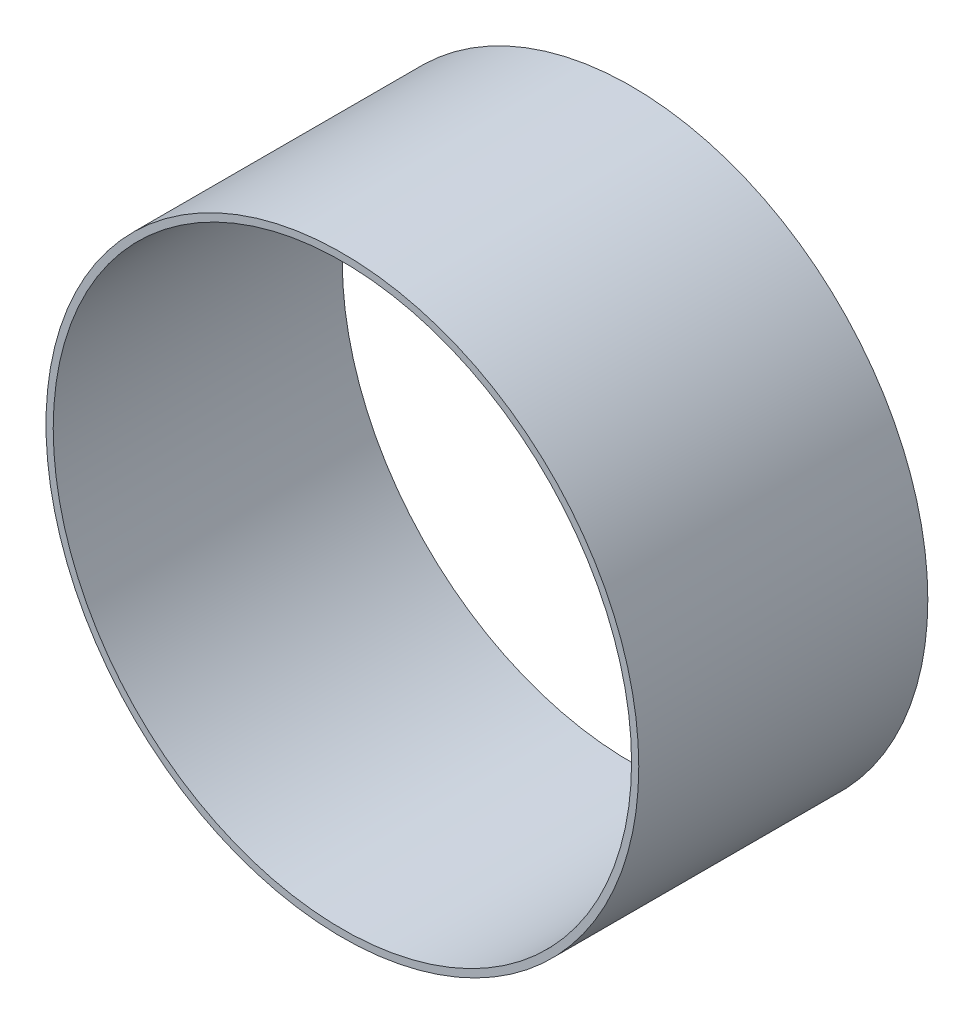
ISO-10303-21;
HEADER;
FILE_DESCRIPTION(('STEP AP214'),'2;1');
FILE_NAME('part.step','',(''),(''),'','','');
FILE_SCHEMA(('AUTOMOTIVE_DESIGN { 1 0 10303 214 1 1 1 1 }'));
ENDSEC;
DATA;
#1=APPLICATION_CONTEXT('core data for automotive mechanical design processes');
#2=APPLICATION_PROTOCOL_DEFINITION('international standard','automotive_design',2000,#1);
#3=PRODUCT_CONTEXT('',#1,'mechanical');
#4=PRODUCT('Part','Part','',(#3));
#5=PRODUCT_RELATED_PRODUCT_CATEGORY('part','',(#4));
#6=PRODUCT_DEFINITION_FORMATION('','',#4);
#7=PRODUCT_DEFINITION_CONTEXT('part definition',#1,'design');
#8=PRODUCT_DEFINITION('design','',#6,#7);
#9=PRODUCT_DEFINITION_SHAPE('','',#8);
#10=(LENGTH_UNIT() NAMED_UNIT(*) SI_UNIT(.MILLI.,.METRE.));
#11=(NAMED_UNIT(*) PLANE_ANGLE_UNIT() SI_UNIT($,.RADIAN.));
#12=(NAMED_UNIT(*) SI_UNIT($,.STERADIAN.) SOLID_ANGLE_UNIT());
#13=UNCERTAINTY_MEASURE_WITH_UNIT(LENGTH_MEASURE(1.E-05),#10,'distance_accuracy_value','');
#14=(GEOMETRIC_REPRESENTATION_CONTEXT(3) GLOBAL_UNCERTAINTY_ASSIGNED_CONTEXT((#13)) GLOBAL_UNIT_ASSIGNED_CONTEXT((#10,
#11,#12)) REPRESENTATION_CONTEXT('',''));
#15=CARTESIAN_POINT('',(0.,0.,0.));
#16=DIRECTION('',(0.,0.,1.));
#17=DIRECTION('',(1.,0.,0.));
#18=AXIS2_PLACEMENT_3D('',#15,#16,#17);
#19=CARTESIAN_POINT('',(0.,0.,20.));
#20=DIRECTION('',(0.,0.,1.));
#21=DIRECTION('',(1.,0.,0.));
#22=AXIS2_PLACEMENT_3D('',#19,#20,#21);
#23=PLANE('',#22);
#24=CARTESIAN_POINT('',(0.,0.,20.));
#25=DIRECTION('',(0.,0.,1.));
#26=DIRECTION('',(1.,0.,0.));
#27=AXIS2_PLACEMENT_3D('',#24,#25,#26);
#28=CIRCLE('',#27,41.016);
#29=CARTESIAN_POINT('',(41.016,0.,20.));
#30=VERTEX_POINT('',#29);
#31=EDGE_CURVE('E11',#30,#30,#28,.T.);
#32=ORIENTED_EDGE('',*,*,#31,.T.);
#33=EDGE_LOOP('',(#32));
#34=FACE_BOUND('',#33,.T.);
#35=CARTESIAN_POINT('',(0.,0.,20.));
#36=DIRECTION('',(0.,0.,1.));
#37=DIRECTION('',(1.,0.,0.));
#38=AXIS2_PLACEMENT_3D('',#35,#36,#37);
#39=CIRCLE('',#38,40.016);
#40=CARTESIAN_POINT('',(40.016,0.,20.));
#41=VERTEX_POINT('',#40);
#42=EDGE_CURVE('E47',#41,#41,#39,.T.);
#43=ORIENTED_EDGE('',*,*,#42,.F.);
#44=EDGE_LOOP('',(#43));
#45=FACE_BOUND('',#44,.T.);
#46=ADVANCED_FACE('F36',(#34,#45),#23,.T.);
#47=CARTESIAN_POINT('',(0.,0.,-20.));
#48=DIRECTION('',(0.,0.,1.));
#49=DIRECTION('',(1.,0.,0.));
#50=AXIS2_PLACEMENT_3D('',#47,#48,#49);
#51=PLANE('',#50);
#52=CARTESIAN_POINT('',(0.,0.,-20.));
#53=DIRECTION('',(0.,0.,1.));
#54=DIRECTION('',(1.,0.,0.));
#55=AXIS2_PLACEMENT_3D('',#52,#53,#54);
#56=CIRCLE('',#55,41.016);
#57=CARTESIAN_POINT('',(41.016,0.,-20.));
#58=VERTEX_POINT('',#57);
#59=EDGE_CURVE('E40',#58,#58,#56,.T.);
#60=ORIENTED_EDGE('',*,*,#59,.F.);
#61=EDGE_LOOP('',(#60));
#62=FACE_BOUND('',#61,.T.);
#63=CARTESIAN_POINT('',(0.,0.,-20.));
#64=DIRECTION('',(0.,0.,1.));
#65=DIRECTION('',(1.,0.,0.));
#66=AXIS2_PLACEMENT_3D('',#63,#64,#65);
#67=CIRCLE('',#66,40.016);
#68=CARTESIAN_POINT('',(40.016,0.,-20.));
#69=VERTEX_POINT('',#68);
#70=EDGE_CURVE('E49',#69,#69,#67,.T.);
#71=ORIENTED_EDGE('',*,*,#70,.T.);
#72=EDGE_LOOP('',(#71));
#73=FACE_BOUND('',#72,.T.);
#74=ADVANCED_FACE('F59',(#62,#73),#51,.F.);
#75=CARTESIAN_POINT('',(0.,0.,20.));
#76=DIRECTION('',(0.,0.,-1.));
#77=DIRECTION('',(-1.,0.,0.));
#78=AXIS2_PLACEMENT_3D('',#75,#76,#77);
#79=CYLINDRICAL_SURFACE('',#78,41.016);
#80=ORIENTED_EDGE('',*,*,#31,.F.);
#81=EDGE_LOOP('',(#80));
#82=FACE_BOUND('',#81,.T.);
#83=ORIENTED_EDGE('',*,*,#59,.T.);
#84=EDGE_LOOP('',(#83));
#85=FACE_BOUND('',#84,.T.);
#86=ADVANCED_FACE('F38',(#82,#85),#79,.T.);
#87=CARTESIAN_POINT('',(0.,0.,20.));
#88=DIRECTION('',(0.,0.,-1.));
#89=DIRECTION('',(-1.,0.,0.));
#90=AXIS2_PLACEMENT_3D('',#87,#88,#89);
#91=CYLINDRICAL_SURFACE('',#90,40.016);
#92=ORIENTED_EDGE('',*,*,#42,.T.);
#93=EDGE_LOOP('',(#92));
#94=FACE_BOUND('',#93,.T.);
#95=ORIENTED_EDGE('',*,*,#70,.F.);
#96=EDGE_LOOP('',(#95));
#97=FACE_BOUND('',#96,.T.);
#98=ADVANCED_FACE('F55',(#94,#97),#91,.F.);
#99=CLOSED_SHELL('',(#46,#74,#86,#98));
#100=MANIFOLD_SOLID_BREP('B2',#99);
#101=ADVANCED_BREP_SHAPE_REPRESENTATION('',(#18,#100),#14);
#102=SHAPE_DEFINITION_REPRESENTATION(#9,#101);
ENDSEC;
END-ISO-10303-21;
